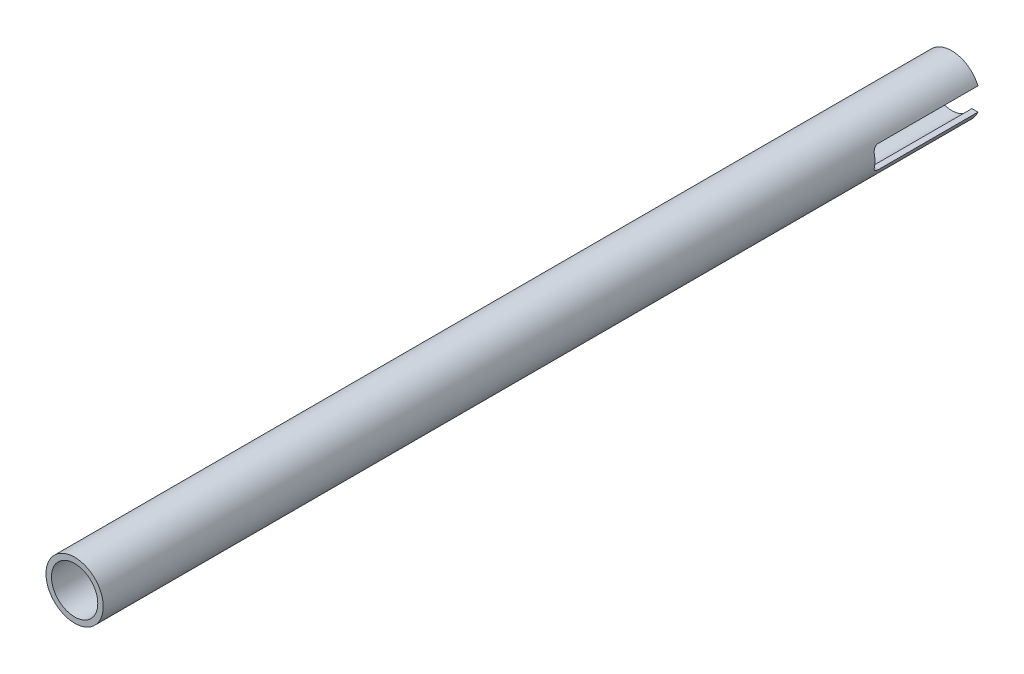
ISO-10303-21;
HEADER;
FILE_DESCRIPTION(('STEP AP214'),'2;1');
FILE_NAME('part.step','',(''),(''),'','','');
FILE_SCHEMA(('AUTOMOTIVE_DESIGN { 1 0 10303 214 1 1 1 1 }'));
ENDSEC;
DATA;
#1=APPLICATION_CONTEXT('core data for automotive mechanical design processes');
#2=APPLICATION_PROTOCOL_DEFINITION('international standard','automotive_design',2000,#1);
#3=PRODUCT_CONTEXT('',#1,'mechanical');
#4=PRODUCT('Part','Part','',(#3));
#5=PRODUCT_RELATED_PRODUCT_CATEGORY('part','',(#4));
#6=PRODUCT_DEFINITION_FORMATION('','',#4);
#7=PRODUCT_DEFINITION_CONTEXT('part definition',#1,'design');
#8=PRODUCT_DEFINITION('design','',#6,#7);
#9=PRODUCT_DEFINITION_SHAPE('','',#8);
#10=(LENGTH_UNIT() NAMED_UNIT(*) SI_UNIT(.MILLI.,.METRE.));
#11=(NAMED_UNIT(*) PLANE_ANGLE_UNIT() SI_UNIT($,.RADIAN.));
#12=(NAMED_UNIT(*) SI_UNIT($,.STERADIAN.) SOLID_ANGLE_UNIT());
#13=UNCERTAINTY_MEASURE_WITH_UNIT(LENGTH_MEASURE(1.E-05),#10,'distance_accuracy_value','');
#14=(GEOMETRIC_REPRESENTATION_CONTEXT(3) GLOBAL_UNCERTAINTY_ASSIGNED_CONTEXT((#13)) GLOBAL_UNIT_ASSIGNED_CONTEXT((#10,
#11,#12)) REPRESENTATION_CONTEXT('',''));
#15=CARTESIAN_POINT('',(0.,0.,0.));
#16=DIRECTION('',(0.,0.,1.));
#17=DIRECTION('',(1.,0.,0.));
#18=AXIS2_PLACEMENT_3D('',#15,#16,#17);
#19=CARTESIAN_POINT('',(0.,0.,0.));
#20=DIRECTION('',(0.,0.,1.));
#21=DIRECTION('',(1.,0.,0.));
#22=AXIS2_PLACEMENT_3D('',#19,#20,#21);
#23=PLANE('',#22);
#24=DIRECTION('',(-1.,0.,0.));
#25=VECTOR('',#24,1.);
#26=CARTESIAN_POINT('',(317.691841615587,-3.17500000000001,0.));
#27=LINE('',#26,#25);
#28=CARTESIAN_POINT('',(7.34407080575888,-3.17500000000001,0.));
#29=VERTEX_POINT('',#28);
#30=CARTESIAN_POINT('',(5.64543213580679,-3.17499999999999,0.));
#31=VERTEX_POINT('',#30);
#32=EDGE_CURVE('E57',#29,#31,#27,.T.);
#33=ORIENTED_EDGE('',*,*,#32,.F.);
#34=CARTESIAN_POINT('',(0.,0.,0.));
#35=DIRECTION('',(0.,0.,1.));
#36=DIRECTION('',(1.,0.,0.));
#37=AXIS2_PLACEMENT_3D('',#34,#35,#36);
#38=CIRCLE('',#37,8.001);
#39=CARTESIAN_POINT('',(-7.34407080575888,-3.17500000000001,0.));
#40=VERTEX_POINT('',#39);
#41=EDGE_CURVE('E146',#40,#29,#38,.T.);
#42=ORIENTED_EDGE('',*,*,#41,.F.);
#43=CARTESIAN_POINT('',(-5.64543213580682,-3.17500000000001,0.));
#44=VERTEX_POINT('',#43);
#45=EDGE_CURVE('E140',#44,#40,#27,.T.);
#46=ORIENTED_EDGE('',*,*,#45,.F.);
#47=CARTESIAN_POINT('',(0.,0.,0.));
#48=DIRECTION('',(0.,0.,1.));
#49=DIRECTION('',(1.,0.,0.));
#50=AXIS2_PLACEMENT_3D('',#47,#48,#49);
#51=CIRCLE('',#50,6.477);
#52=EDGE_CURVE('E242',#44,#31,#51,.T.);
#53=ORIENTED_EDGE('',*,*,#52,.T.);
#54=EDGE_LOOP('',(#33,#42,#46,#53));
#55=FACE_BOUND('',#54,.T.);
#56=ADVANCED_FACE('F33',(#55),#23,.F.);
#57=CARTESIAN_POINT('',(0.,0.,245.11));
#58=DIRECTION('',(0.,0.,-1.));
#59=DIRECTION('',(-1.,0.,0.));
#60=AXIS2_PLACEMENT_3D('',#57,#58,#59);
#61=CYLINDRICAL_SURFACE('',#60,8.001);
#62=CARTESIAN_POINT('',(0.,0.,245.11));
#63=DIRECTION('',(0.,0.,1.));
#64=DIRECTION('',(1.,0.,0.));
#65=AXIS2_PLACEMENT_3D('',#62,#63,#64);
#66=CIRCLE('',#65,8.001);
#67=CARTESIAN_POINT('',(8.001,0.,245.11));
#68=VERTEX_POINT('',#67);
#69=EDGE_CURVE('E249',#68,#68,#66,.T.);
#70=ORIENTED_EDGE('',*,*,#69,.F.);
#71=EDGE_LOOP('',(#70));
#72=FACE_BOUND('',#71,.T.);
#73=DIRECTION('',(0.,0.,-1.));
#74=VECTOR('',#73,1.);
#75=CARTESIAN_POINT('',(7.34407080575892,3.17499999999992,245.11));
#76=LINE('',#75,#74);
#77=CARTESIAN_POINT('',(7.34407080575894,3.175,0.));
#78=VERTEX_POINT('',#77);
#79=CARTESIAN_POINT('',(7.34407080575889,3.17499999999999,27.94));
#80=VERTEX_POINT('',#79);
#81=EDGE_CURVE('E238',#78,#80,#76,.F.);
#82=ORIENTED_EDGE('',*,*,#81,.F.);
#83=CARTESIAN_POINT('',(-7.34407080575894,3.175,0.));
#84=VERTEX_POINT('',#83);
#85=EDGE_CURVE('E253',#78,#84,#38,.T.);
#86=ORIENTED_EDGE('',*,*,#85,.T.);
#87=DIRECTION('',(0.,0.,-1.));
#88=VECTOR('',#87,1.);
#89=CARTESIAN_POINT('',(-7.34407080575892,3.17499999999992,245.11));
#90=LINE('',#89,#88);
#91=CARTESIAN_POINT('',(-7.34407080575889,3.17499999999999,27.94));
#92=VERTEX_POINT('',#91);
#93=EDGE_CURVE('E240',#92,#84,#90,.T.);
#94=ORIENTED_EDGE('',*,*,#93,.F.);
#95=CARTESIAN_POINT('',(-7.8288057837706,1.65099999999999,29.464));
#96=CARTESIAN_POINT('',(-7.81947795268345,1.69524181564514,29.4639996807889));
#97=CARTESIAN_POINT('',(-7.80977555287386,1.73937906238703,29.4620725755956));
#98=CARTESIAN_POINT('',(-7.7897053190962,1.82715995012294,29.4544259194222));
#99=CARTESIAN_POINT('',(-7.77933765259943,1.870803712116,29.4487073195399));
#100=CARTESIAN_POINT('',(-7.74740781787862,2.00038689143379,29.4259920832168));
#101=CARTESIAN_POINT('',(-7.72497172734663,2.08520038066884,29.4034353611242));
#102=CARTESIAN_POINT('',(-7.67879255624773,2.24931803273243,29.3443529357356));
#103=CARTESIAN_POINT('',(-7.65505009243317,2.32862475603218,29.307833776622));
#104=CARTESIAN_POINT('',(-7.60739952527334,2.47987144136615,29.2218403935313));
#105=CARTESIAN_POINT('',(-7.58349136309819,2.55180862700726,29.1723613118312));
#106=CARTESIAN_POINT('',(-7.53640113822511,2.68773877112478,29.0605553900397));
#107=CARTESIAN_POINT('',(-7.51324222932275,2.75155008701076,28.9979974672164));
#108=CARTESIAN_POINT('',(-7.46969556535498,2.86766507697724,28.8621080561482));
#109=CARTESIAN_POINT('',(-7.44930787514765,2.91996848174228,28.7887763158346));
#110=CARTESIAN_POINT('',(-7.41339882631975,3.00995182097469,28.635356056821));
#111=CARTESIAN_POINT('',(-7.39775949227146,3.04799299625044,28.555507568052));
#112=CARTESIAN_POINT('',(-7.37198636942665,3.10981595853761,28.3896963126839));
#113=CARTESIAN_POINT('',(-7.36184321814923,3.13362200161646,28.3037442276388));
#114=CARTESIAN_POINT('',(-7.35134082404798,3.15814271182933,28.170748149592));
#115=CARTESIAN_POINT('',(-7.34862226710174,3.16445643648463,28.1248527548858));
#116=CARTESIAN_POINT('',(-7.34498545577234,3.17288497032065,28.0326477775769));
#117=CARTESIAN_POINT('',(-7.34406565426136,3.17500338794749,27.9863385853611));
#118=CARTESIAN_POINT('',(-7.34407080575889,3.17499999999999,27.94));
#119=B_SPLINE_CURVE_WITH_KNOTS('',3,(#95,#96,#97,#98,#99,#100,#101,#102,#103,#104,#105,#106,
#107,#108,#109,#110,#111,#112,#113,#114,#115,#116,#117,#118),.UNSPECIFIED.,.F.,.F.,(4,2,2,2,2,2,
2,2,2,2,2,4),(0.,0.135553024626245,0.271072058592374,0.541437670457962,0.811676717226676,
1.08201720207601,1.35761362878683,1.63321650449497,1.90127196271359,2.16886935439239,
2.30789050122071,2.44679202186551),.UNSPECIFIED.);
#120=CARTESIAN_POINT('',(-7.8288057837706,1.65099999999999,29.464));
#121=VERTEX_POINT('',#120);
#122=EDGE_CURVE('E226',#121,#92,#119,.T.);
#123=ORIENTED_EDGE('',*,*,#122,.F.);
#124=CARTESIAN_POINT('',(0.,0.,29.464));
#125=DIRECTION('',(0.,0.,-1.));
#126=DIRECTION('',(-1.,0.,0.));
#127=AXIS2_PLACEMENT_3D('',#124,#125,#126);
#128=CIRCLE('',#127,8.001);
#129=CARTESIAN_POINT('',(-7.8288057837706,-1.651,29.464));
#130=VERTEX_POINT('',#129);
#131=EDGE_CURVE('E134',#130,#121,#128,.T.);
#132=ORIENTED_EDGE('',*,*,#131,.F.);
#133=CARTESIAN_POINT('',(-7.34407080575888,-3.175,27.94));
#134=CARTESIAN_POINT('',(-7.3440680096913,-3.17500157818638,27.9806984476088));
#135=CARTESIAN_POINT('',(-7.34477630214677,-3.17336860893187,28.0213759502433));
#136=CARTESIAN_POINT('',(-7.34758309143993,-3.16686635956913,28.102411407968));
#137=CARTESIAN_POINT('',(-7.34968118035477,-3.16199802907896,28.1427694533067));
#138=CARTESIAN_POINT('',(-7.35798857580184,-3.14264423927033,28.2626338560667));
#139=CARTESIAN_POINT('',(-7.36621159330718,-3.12340930879257,28.3412906881812));
#140=CARTESIAN_POINT('',(-7.38735918413182,-3.07305366060584,28.4938993996992));
#141=CARTESIAN_POINT('',(-7.40028060607282,-3.04194090905529,28.567854393813));
#142=CARTESIAN_POINT('',(-7.4298815779994,-2.96890708335138,28.7094453435949));
#143=CARTESIAN_POINT('',(-7.44656372650464,-2.92697853298672,28.7770768840646));
#144=CARTESIAN_POINT('',(-7.48338951433548,-2.83153727514407,28.9073193992745));
#145=CARTESIAN_POINT('',(-7.5036517696014,-2.77760154335605,28.9695861247467));
#146=CARTESIAN_POINT('',(-7.54586923311684,-2.66077336101834,29.0843978381578));
#147=CARTESIAN_POINT('',(-7.56782510086072,-2.59787741319581,29.1369390116058));
#148=CARTESIAN_POINT('',(-7.61377353576087,-2.46009532987571,29.23442490565));
#149=CARTESIAN_POINT('',(-7.63780327629239,-2.38468542927396,29.278613263246));
#150=CARTESIAN_POINT('',(-7.68517828309943,-2.22728162943213,29.3535295949975));
#151=CARTESIAN_POINT('',(-7.70852388215322,-2.14529100625114,29.3842642181982));
#152=CARTESIAN_POINT('',(-7.74866065435345,-1.99473307846588,29.4263269168587));
#153=CARTESIAN_POINT('',(-7.76579152458538,-1.9270088220366,29.4403889784846));
#154=CARTESIAN_POINT('',(-7.79853598216448,-1.78994063052702,29.4592336722557));
#155=CARTESIAN_POINT('',(-7.81414985826825,-1.7205970068191,29.4640180736839));
#156=CARTESIAN_POINT('',(-7.8288057837706,-1.651,29.464));
#157=B_SPLINE_CURVE_WITH_KNOTS('',3,(#133,#134,#135,#136,#137,#138,#139,#140,#141,#142,#143,
#144,#145,#146,#147,#148,#149,#150,#151,#152,#153,#154,#155,#156),.UNSPECIFIED.,.F.,.F.,(4,2,2,
2,2,2,2,2,2,2,2,4),(0.,0.12201561431295,0.243995431359554,0.486888996424004,0.729619944201783,
0.972519126749115,1.225937118326,1.47945429417213,1.75015649231414,2.02072475374975,
2.23388433321155,2.44700325838137),.UNSPECIFIED.);
#158=CARTESIAN_POINT('',(-7.34407080575888,-3.175,27.94));
#159=VERTEX_POINT('',#158);
#160=EDGE_CURVE('E135',#159,#130,#157,.T.);
#161=ORIENTED_EDGE('',*,*,#160,.F.);
#162=DIRECTION('',(0.,0.,-1.));
#163=VECTOR('',#162,1.);
#164=CARTESIAN_POINT('',(-7.34407080575889,-3.17499999999999,245.11));
#165=LINE('',#164,#163);
#166=EDGE_CURVE('E147',#40,#159,#165,.F.);
#167=ORIENTED_EDGE('',*,*,#166,.F.);
#168=ORIENTED_EDGE('',*,*,#41,.T.);
#169=DIRECTION('',(0.,0.,-1.));
#170=VECTOR('',#169,1.);
#171=CARTESIAN_POINT('',(7.34407080575889,-3.17499999999999,245.11));
#172=LINE('',#171,#170);
#173=CARTESIAN_POINT('',(7.34407080575888,-3.175,27.94));
#174=VERTEX_POINT('',#173);
#175=EDGE_CURVE('E138',#174,#29,#172,.T.);
#176=ORIENTED_EDGE('',*,*,#175,.F.);
#177=CARTESIAN_POINT('',(7.8288057837706,-1.651,29.464));
#178=CARTESIAN_POINT('',(7.81947795268344,-1.69524181564515,29.4639996807889));
#179=CARTESIAN_POINT('',(7.80977555287386,-1.73937906238705,29.4620725755956));
#180=CARTESIAN_POINT('',(7.78970531909619,-1.82715995012295,29.4544259194222));
#181=CARTESIAN_POINT('',(7.77933765259943,-1.87080371211601,29.4487073195399));
#182=CARTESIAN_POINT('',(7.74740781787862,-2.0003868914338,29.4259920832168));
#183=CARTESIAN_POINT('',(7.72497172734662,-2.08520038066886,29.4034353611242));
#184=CARTESIAN_POINT('',(7.67879255624773,-2.24931803273244,29.3443529357356));
#185=CARTESIAN_POINT('',(7.65505009243317,-2.32862475603219,29.307833776622));
#186=CARTESIAN_POINT('',(7.60739952527334,-2.47987144136616,29.2218403935313));
#187=CARTESIAN_POINT('',(7.58349136309819,-2.55180862700727,29.1723613118312));
#188=CARTESIAN_POINT('',(7.5364011382251,-2.6877387711248,29.0605553900397));
#189=CARTESIAN_POINT('',(7.51324222932275,-2.75155008701078,28.9979974672164));
#190=CARTESIAN_POINT('',(7.46969556535497,-2.86766507697726,28.8621080561482));
#191=CARTESIAN_POINT('',(7.44930787514765,-2.9199684817423,28.7887763158346));
#192=CARTESIAN_POINT('',(7.41339882631975,-3.0099518209747,28.635356056821));
#193=CARTESIAN_POINT('',(7.39775949227145,-3.04799299625045,28.555507568052));
#194=CARTESIAN_POINT('',(7.37198636942665,-3.10981595853763,28.3896963126839));
#195=CARTESIAN_POINT('',(7.36184321814923,-3.13362200161647,28.3037442276388));
#196=CARTESIAN_POINT('',(7.35134082404798,-3.15814271182935,28.170748149592));
#197=CARTESIAN_POINT('',(7.34862226710173,-3.16445643648464,28.1248527548858));
#198=CARTESIAN_POINT('',(7.34498545577233,-3.17288497032067,28.0326477775769));
#199=CARTESIAN_POINT('',(7.34406565426135,-3.17500338794751,27.9863385853611));
#200=CARTESIAN_POINT('',(7.34407080575888,-3.175,27.94));
#201=B_SPLINE_CURVE_WITH_KNOTS('',3,(#177,#178,#179,#180,#181,#182,#183,#184,#185,#186,#187,
#188,#189,#190,#191,#192,#193,#194,#195,#196,#197,#198,#199,#200),.UNSPECIFIED.,.F.,.F.,(4,2,2,
2,2,2,2,2,2,2,2,4),(0.,0.135553024626244,0.271072058592373,0.541437670457962,0.811676717226674,
1.08201720207601,1.35761362878684,1.63321650449498,1.9012719627136,2.16886935439239,
2.30789050122071,2.44679202186551),.UNSPECIFIED.);
#202=CARTESIAN_POINT('',(7.8288057837706,-1.651,29.464));
#203=VERTEX_POINT('',#202);
#204=EDGE_CURVE('E124',#203,#174,#201,.T.);
#205=ORIENTED_EDGE('',*,*,#204,.F.);
#206=CARTESIAN_POINT('',(7.8288057837706,1.65099999999999,29.464));
#207=VERTEX_POINT('',#206);
#208=EDGE_CURVE('E232',#207,#203,#128,.T.);
#209=ORIENTED_EDGE('',*,*,#208,.F.);
#210=CARTESIAN_POINT('',(7.34407080575889,3.17499999999999,27.94));
#211=CARTESIAN_POINT('',(7.34406800969131,3.17500157818637,27.9806984476088));
#212=CARTESIAN_POINT('',(7.34477630214678,3.17336860893186,28.0213759502433));
#213=CARTESIAN_POINT('',(7.34758309143993,3.16686635956911,28.102411407968));
#214=CARTESIAN_POINT('',(7.34968118035478,3.16199802907895,28.1427694533067));
#215=CARTESIAN_POINT('',(7.35798857580184,3.14264423927032,28.2626338560667));
#216=CARTESIAN_POINT('',(7.36621159330719,3.12340930879256,28.3412906881812));
#217=CARTESIAN_POINT('',(7.38735918413182,3.07305366060582,28.4938993996992));
#218=CARTESIAN_POINT('',(7.40028060607282,3.04194090905528,28.567854393813));
#219=CARTESIAN_POINT('',(7.4298815779994,2.96890708335136,28.7094453435949));
#220=CARTESIAN_POINT('',(7.44656372650465,2.92697853298671,28.7770768840646));
#221=CARTESIAN_POINT('',(7.48338951433549,2.83153727514406,28.9073193992745));
#222=CARTESIAN_POINT('',(7.50365176960141,2.77760154335604,28.9695861247467));
#223=CARTESIAN_POINT('',(7.54586923311685,2.66077336101832,29.0843978381578));
#224=CARTESIAN_POINT('',(7.56782510086072,2.5978774131958,29.1369390116058));
#225=CARTESIAN_POINT('',(7.61377353576087,2.4600953298757,29.23442490565));
#226=CARTESIAN_POINT('',(7.6378032762924,2.38468542927395,29.278613263246));
#227=CARTESIAN_POINT('',(7.68517828309944,2.22728162943211,29.3535295949975));
#228=CARTESIAN_POINT('',(7.70852388215323,2.14529100625113,29.3842642181981));
#229=CARTESIAN_POINT('',(7.74866065435345,1.99473307846587,29.4263269168587));
#230=CARTESIAN_POINT('',(7.76579152458538,1.92700882203658,29.4403889784846));
#231=CARTESIAN_POINT('',(7.79853598216448,1.78994063052701,29.4592336722557));
#232=CARTESIAN_POINT('',(7.81414985826825,1.72059700681908,29.4640180736839));
#233=CARTESIAN_POINT('',(7.8288057837706,1.65099999999999,29.464));
#234=B_SPLINE_CURVE_WITH_KNOTS('',3,(#210,#211,#212,#213,#214,#215,#216,#217,#218,#219,#220,
#221,#222,#223,#224,#225,#226,#227,#228,#229,#230,#231,#232,#233),.UNSPECIFIED.,.F.,.F.,(4,2,2,
2,2,2,2,2,2,2,2,4),(0.,0.12201561431295,0.243995431359554,0.486888996424004,0.729619944201783,
0.972519126749115,1.22593711832599,1.47945429417213,1.75015649231413,2.02072475374975,
2.23388433321155,2.44700325838137),.UNSPECIFIED.);
#235=EDGE_CURVE('E231',#80,#207,#234,.T.);
#236=ORIENTED_EDGE('',*,*,#235,.F.);
#237=EDGE_LOOP('',(#82,#86,#94,#123,#132,#161,#167,#168,#176,#205,#209,#236));
#238=FACE_BOUND('',#237,.T.);
#239=ADVANCED_FACE('F35',(#72,#238),#61,.T.);
#240=CARTESIAN_POINT('',(0.,0.,245.11));
#241=DIRECTION('',(0.,0.,-1.));
#242=DIRECTION('',(-1.,0.,0.));
#243=AXIS2_PLACEMENT_3D('',#240,#241,#242);
#244=CYLINDRICAL_SURFACE('',#243,6.477);
#245=CARTESIAN_POINT('',(0.,0.,245.11));
#246=DIRECTION('',(0.,0.,1.));
#247=DIRECTION('',(1.,0.,0.));
#248=AXIS2_PLACEMENT_3D('',#245,#246,#247);
#249=CIRCLE('',#248,6.477);
#250=CARTESIAN_POINT('',(6.477,0.,245.11));
#251=VERTEX_POINT('',#250);
#252=EDGE_CURVE('E243',#251,#251,#249,.T.);
#253=ORIENTED_EDGE('',*,*,#252,.T.);
#254=EDGE_LOOP('',(#253));
#255=FACE_BOUND('',#254,.T.);
#256=CARTESIAN_POINT('',(5.64543213580682,3.175,0.));
#257=VERTEX_POINT('',#256);
#258=CARTESIAN_POINT('',(-5.64543213580682,3.175,0.));
#259=VERTEX_POINT('',#258);
#260=EDGE_CURVE('E246',#257,#259,#51,.T.);
#261=ORIENTED_EDGE('',*,*,#260,.F.);
#262=DIRECTION('',(0.,0.,-1.));
#263=VECTOR('',#262,1.);
#264=CARTESIAN_POINT('',(5.64543213580683,3.17499999999992,245.11));
#265=LINE('',#264,#263);
#266=CARTESIAN_POINT('',(5.64543213580679,3.17499999999999,27.94));
#267=VERTEX_POINT('',#266);
#268=EDGE_CURVE('E11',#257,#267,#265,.F.);
#269=ORIENTED_EDGE('',*,*,#268,.T.);
#270=CARTESIAN_POINT('',(5.64543213580679,3.17499999999999,27.94));
#271=CARTESIAN_POINT('',(5.64542798532432,3.17500253012491,27.9795022750384));
#272=CARTESIAN_POINT('',(5.64629676751123,3.17346305780188,28.0189831851797));
#273=CARTESIAN_POINT('',(5.64973489172762,3.16734010596934,28.097616333837));
#274=CARTESIAN_POINT('',(5.65230347216193,3.16275798971433,28.1367687115998));
#275=CARTESIAN_POINT('',(5.6624528235623,3.14457608288719,28.2529070155873));
#276=CARTESIAN_POINT('',(5.67247830845162,3.12653965087181,28.3290381879893));
#277=CARTESIAN_POINT('',(5.69814957474154,3.07950075965754,28.4766255007952));
#278=CARTESIAN_POINT('',(5.71378770060105,3.05051323473278,28.5480878532046));
#279=CARTESIAN_POINT('',(5.74949312759986,2.98267072120713,28.6850337996201));
#280=CARTESIAN_POINT('',(5.76956543427929,2.94380457356396,28.7505105176722));
#281=CARTESIAN_POINT('',(5.81427344287328,2.85454020484129,28.8783725064171));
#282=CARTESIAN_POINT('',(5.83912294015509,2.80355001313473,28.9402682413202));
#283=CARTESIAN_POINT('',(5.89090094280743,2.69305400468479,29.0549190340714));
#284=CARTESIAN_POINT('',(5.91783040535228,2.63354425646504,29.1076698468731));
#285=CARTESIAN_POINT('',(5.9754026920417,2.50037980782341,29.2083991647787));
#286=CARTESIAN_POINT('',(6.00613015030678,2.42589024924425,29.2552294493506));
#287=CARTESIAN_POINT('',(6.06685054178971,2.26977298542592,29.3354912659983));
#288=CARTESIAN_POINT('',(6.09684379767183,2.18814849062352,29.3689287868608));
#289=CARTESIAN_POINT('',(6.15068954263711,2.03135452128191,29.4177262918858));
#290=CARTESIAN_POINT('',(6.17481721444706,1.95685658409068,29.4349485076857));
#291=CARTESIAN_POINT('',(6.2208090046563,1.80539896583251,29.4581012531514));
#292=CARTESIAN_POINT('',(6.24267154884634,1.72843762073706,29.4640239790673));
#293=CARTESIAN_POINT('',(6.26304462701648,1.65099999999999,29.464));
#294=B_SPLINE_CURVE_WITH_KNOTS('',3,(#270,#271,#272,#273,#274,#275,#276,#277,#278,#279,#280,
#281,#282,#283,#284,#285,#286,#287,#288,#289,#290,#291,#292,#293),.UNSPECIFIED.,.F.,.F.,(4,2,2,
2,2,2,2,2,2,2,2,4),(0.,0.11842611788255,0.236799210795264,0.472172634307249,0.707226225252081,
0.942546525606805,1.19340365391803,1.44437691938388,1.72272641785955,2.0009513086068,
2.24064521780671,2.48050460661626),.UNSPECIFIED.);
#295=CARTESIAN_POINT('',(6.26304462701648,1.65099999999999,29.464));
#296=VERTEX_POINT('',#295);
#297=EDGE_CURVE('E42',#267,#296,#294,.T.);
#298=ORIENTED_EDGE('',*,*,#297,.T.);
#299=CARTESIAN_POINT('',(0.,0.,29.464));
#300=DIRECTION('',(0.,0.,-1.));
#301=DIRECTION('',(-1.,0.,0.));
#302=AXIS2_PLACEMENT_3D('',#299,#300,#301);
#303=CIRCLE('',#302,6.477);
#304=CARTESIAN_POINT('',(6.26304462701648,-1.651,29.464));
#305=VERTEX_POINT('',#304);
#306=EDGE_CURVE('E189',#296,#305,#303,.T.);
#307=ORIENTED_EDGE('',*,*,#306,.T.);
#308=CARTESIAN_POINT('',(6.26304462701648,-1.651,29.464));
#309=CARTESIAN_POINT('',(6.25119301356599,-1.69597019045451,29.4639996512927));
#310=CARTESIAN_POINT('',(6.23885805015263,-1.74078424361484,29.4620087653986));
#311=CARTESIAN_POINT('',(6.21333080831813,-1.82980515275705,29.454134138941));
#312=CARTESIAN_POINT('',(6.20013884930389,-1.87401222760585,29.4482518413062));
#313=CARTESIAN_POINT('',(6.15951133396887,-2.00506101361784,29.4249457970163));
#314=CARTESIAN_POINT('',(6.13094979172369,-2.09061085165534,29.4018617467996));
#315=CARTESIAN_POINT('',(6.07212151471614,-2.25578612168244,29.3416219603263));
#316=CARTESIAN_POINT('',(6.04185654214358,-2.33541748531391,29.3044805465843));
#317=CARTESIAN_POINT('',(5.98100165398782,-2.48713337520253,29.2171532445204));
#318=CARTESIAN_POINT('',(5.95041151302896,-2.55921223237762,29.1669576544588));
#319=CARTESIAN_POINT('',(5.88959770370069,-2.69629003214929,29.0527307014112));
#320=CARTESIAN_POINT('',(5.85942026108732,-2.76097278644595,28.9882938275107));
#321=CARTESIAN_POINT('',(5.80262181829034,-2.87843237174363,28.8479375307773));
#322=CARTESIAN_POINT('',(5.77600068690932,-2.93120964200445,28.7720185317567));
#323=CARTESIAN_POINT('',(5.72961508062246,-3.02084256755071,28.6138173863488));
#324=CARTESIAN_POINT('',(5.70961192114585,-3.05826802843451,28.5319300118511));
#325=CARTESIAN_POINT('',(5.67705818777086,-3.11828924116529,28.3615909438744));
#326=CARTESIAN_POINT('',(5.66448853762436,-3.14092296814996,28.2731567140417));
#327=CARTESIAN_POINT('',(5.65274801817815,-3.16196375608022,28.143042864781));
#328=CARTESIAN_POINT('',(5.65001234622036,-3.16684526064363,28.1026313476031));
#329=CARTESIAN_POINT('',(5.64635324825543,-3.17336296637714,28.0214890576694));
#330=CARTESIAN_POINT('',(5.64542881846813,-3.17500096508517,27.980758474312));
#331=CARTESIAN_POINT('',(5.64543213580679,-3.175,27.94));
#332=B_SPLINE_CURVE_WITH_KNOTS('',3,(#308,#309,#310,#311,#312,#313,#314,#315,#316,#317,#318,
#319,#320,#321,#322,#323,#324,#325,#326,#327,#328,#329,#330,#331),.UNSPECIFIED.,.F.,.F.,(4,2,2,
2,2,2,2,2,2,2,2,4),(0.,0.13941997674178,0.278788285754549,0.556665652257205,0.834260658887698,
1.11206256399923,1.39912695233711,1.68618074753331,1.96132294859871,2.23575596690123,
2.35800176569004,2.4801797973654),.UNSPECIFIED.);
#333=CARTESIAN_POINT('',(5.64543213580682,-3.175,27.94));
#334=VERTEX_POINT('',#333);
#335=EDGE_CURVE('E183',#305,#334,#332,.T.);
#336=ORIENTED_EDGE('',*,*,#335,.T.);
#337=DIRECTION('',(0.,0.,-1.));
#338=VECTOR('',#337,1.);
#339=CARTESIAN_POINT('',(5.64543213580679,-3.17499999999999,245.11));
#340=LINE('',#339,#338);
#341=EDGE_CURVE('E139',#334,#31,#340,.T.);
#342=ORIENTED_EDGE('',*,*,#341,.T.);
#343=ORIENTED_EDGE('',*,*,#52,.F.);
#344=DIRECTION('',(0.,0.,-1.));
#345=VECTOR('',#344,1.);
#346=CARTESIAN_POINT('',(-5.64543213580679,-3.17499999999999,245.11));
#347=LINE('',#346,#345);
#348=CARTESIAN_POINT('',(-5.64543213580679,-3.17499999999999,27.94));
#349=VERTEX_POINT('',#348);
#350=EDGE_CURVE('E252',#44,#349,#347,.F.);
#351=ORIENTED_EDGE('',*,*,#350,.T.);
#352=CARTESIAN_POINT('',(-5.64543213580679,-3.175,27.94));
#353=CARTESIAN_POINT('',(-5.64542798532432,-3.17500253012492,27.9795022750384));
#354=CARTESIAN_POINT('',(-5.64629676751122,-3.17346305780189,28.0189831851797));
#355=CARTESIAN_POINT('',(-5.64973489172761,-3.16734010596935,28.097616333837));
#356=CARTESIAN_POINT('',(-5.65230347216192,-3.16275798971435,28.1367687115998));
#357=CARTESIAN_POINT('',(-5.6624528235623,-3.1445760828872,28.2529070155873));
#358=CARTESIAN_POINT('',(-5.67247830845161,-3.12653965087182,28.3290381879893));
#359=CARTESIAN_POINT('',(-5.69814957474154,-3.07950075965756,28.4766255007952));
#360=CARTESIAN_POINT('',(-5.71378770060104,-3.05051323473279,28.5480878532046));
#361=CARTESIAN_POINT('',(-5.74949312759985,-2.98267072120715,28.6850337996201));
#362=CARTESIAN_POINT('',(-5.76956543427929,-2.94380457356397,28.7505105176722));
#363=CARTESIAN_POINT('',(-5.81427344287327,-2.8545402048413,28.8783725064171));
#364=CARTESIAN_POINT('',(-5.83912294015508,-2.80355001313474,28.9402682413202));
#365=CARTESIAN_POINT('',(-5.89090094280742,-2.69305400468481,29.0549190340714));
#366=CARTESIAN_POINT('',(-5.91783040535228,-2.63354425646506,29.1076698468731));
#367=CARTESIAN_POINT('',(-5.97540269204169,-2.50037980782343,29.2083991647787));
#368=CARTESIAN_POINT('',(-6.00613015030677,-2.42589024924427,29.2552294493506));
#369=CARTESIAN_POINT('',(-6.06685054178971,-2.26977298542593,29.3354912659983));
#370=CARTESIAN_POINT('',(-6.09684379767183,-2.18814849062354,29.3689287868608));
#371=CARTESIAN_POINT('',(-6.1506895426371,-2.03135452128192,29.4177262918858));
#372=CARTESIAN_POINT('',(-6.17481721444706,-1.95685658409069,29.4349485076857));
#373=CARTESIAN_POINT('',(-6.2208090046563,-1.80539896583253,29.4581012531514));
#374=CARTESIAN_POINT('',(-6.24267154884634,-1.72843762073707,29.4640239790673));
#375=CARTESIAN_POINT('',(-6.26304462701648,-1.651,29.464));
#376=B_SPLINE_CURVE_WITH_KNOTS('',3,(#352,#353,#354,#355,#356,#357,#358,#359,#360,#361,#362,
#363,#364,#365,#366,#367,#368,#369,#370,#371,#372,#373,#374,#375),.UNSPECIFIED.,.F.,.F.,(4,2,2,
2,2,2,2,2,2,2,2,4),(0.,0.11842611788255,0.236799210795268,0.472172634307249,0.707226225252081,
0.942546525606805,1.19340365391803,1.44437691938388,1.72272641785955,2.0009513086068,
2.24064521780671,2.48050460661626),.UNSPECIFIED.);
#377=CARTESIAN_POINT('',(-6.26304462701648,-1.651,29.464));
#378=VERTEX_POINT('',#377);
#379=EDGE_CURVE('E173',#349,#378,#376,.T.);
#380=ORIENTED_EDGE('',*,*,#379,.T.);
#381=CARTESIAN_POINT('',(-6.26304462701648,1.65099999999999,29.464));
#382=VERTEX_POINT('',#381);
#383=EDGE_CURVE('E214',#378,#382,#303,.T.);
#384=ORIENTED_EDGE('',*,*,#383,.T.);
#385=CARTESIAN_POINT('',(-6.26304462701648,1.65099999999999,29.464));
#386=CARTESIAN_POINT('',(-6.251193013566,1.6959701904545,29.4639996512927));
#387=CARTESIAN_POINT('',(-6.23885805015264,1.74078424361482,29.4620087653986));
#388=CARTESIAN_POINT('',(-6.21333080831813,1.82980515275704,29.454134138941));
#389=CARTESIAN_POINT('',(-6.20013884930389,1.87401222760583,29.4482518413062));
#390=CARTESIAN_POINT('',(-6.15951133396887,2.00506101361782,29.4249457970163));
#391=CARTESIAN_POINT('',(-6.1309497917237,2.09061085165533,29.4018617467996));
#392=CARTESIAN_POINT('',(-6.07212151471614,2.25578612168242,29.3416219603263));
#393=CARTESIAN_POINT('',(-6.04185654214358,2.3354174853139,29.3044805465843));
#394=CARTESIAN_POINT('',(-5.98100165398783,2.48713337520252,29.2171532445204));
#395=CARTESIAN_POINT('',(-5.95041151302897,2.5592122323776,29.1669576544588));
#396=CARTESIAN_POINT('',(-5.8895977037007,2.69629003214927,29.0527307014112));
#397=CARTESIAN_POINT('',(-5.85942026108733,2.76097278644594,28.9882938275107));
#398=CARTESIAN_POINT('',(-5.80262181829034,2.87843237174362,28.8479375307773));
#399=CARTESIAN_POINT('',(-5.77600068690933,2.93120964200444,28.7720185317567));
#400=CARTESIAN_POINT('',(-5.72961508062246,3.02084256755069,28.6138173863488));
#401=CARTESIAN_POINT('',(-5.70961192114586,3.0582680284345,28.5319300118511));
#402=CARTESIAN_POINT('',(-5.67705818777087,3.11828924116528,28.3615909438744));
#403=CARTESIAN_POINT('',(-5.66448853762437,3.14092296814994,28.2731567140417));
#404=CARTESIAN_POINT('',(-5.65274801817816,3.16196375608021,28.143042864781));
#405=CARTESIAN_POINT('',(-5.65001234622037,3.16684526064362,28.1026313476031));
#406=CARTESIAN_POINT('',(-5.64635324825544,3.17336296637713,28.0214890576694));
#407=CARTESIAN_POINT('',(-5.64542881846814,3.17500096508516,27.980758474312));
#408=CARTESIAN_POINT('',(-5.6454321358068,3.17499999999999,27.94));
#409=B_SPLINE_CURVE_WITH_KNOTS('',3,(#385,#386,#387,#388,#389,#390,#391,#392,#393,#394,#395,
#396,#397,#398,#399,#400,#401,#402,#403,#404,#405,#406,#407,#408),.UNSPECIFIED.,.F.,.F.,(4,2,2,
2,2,2,2,2,2,2,2,4),(0.,0.13941997674178,0.278788285754548,0.556665652257204,0.834260658887697,
1.11206256399923,1.39912695233711,1.68618074753331,1.9613229485987,2.23575596690122,
2.35800176569004,2.4801797973654),.UNSPECIFIED.);
#410=CARTESIAN_POINT('',(-5.64543213580679,3.17499999999999,27.94));
#411=VERTEX_POINT('',#410);
#412=EDGE_CURVE('E207',#382,#411,#409,.T.);
#413=ORIENTED_EDGE('',*,*,#412,.T.);
#414=DIRECTION('',(0.,0.,-1.));
#415=VECTOR('',#414,1.);
#416=CARTESIAN_POINT('',(-5.64543213580683,3.17499999999992,245.11));
#417=LINE('',#416,#415);
#418=EDGE_CURVE('E213',#411,#259,#417,.T.);
#419=ORIENTED_EDGE('',*,*,#418,.T.);
#420=EDGE_LOOP('',(#261,#269,#298,#307,#336,#342,#343,#351,#380,#384,#413,#419));
#421=FACE_BOUND('',#420,.T.);
#422=ADVANCED_FACE('F195',(#255,#421),#244,.F.);
#423=CARTESIAN_POINT('',(0.,0.,245.11));
#424=DIRECTION('',(0.,0.,1.));
#425=DIRECTION('',(1.,0.,0.));
#426=AXIS2_PLACEMENT_3D('',#423,#424,#425);
#427=PLANE('',#426);
#428=ORIENTED_EDGE('',*,*,#69,.T.);
#429=EDGE_LOOP('',(#428));
#430=FACE_BOUND('',#429,.T.);
#431=ORIENTED_EDGE('',*,*,#252,.F.);
#432=EDGE_LOOP('',(#431));
#433=FACE_BOUND('',#432,.T.);
#434=ADVANCED_FACE('F200',(#430,#433),#427,.T.);
#435=ORIENTED_EDGE('',*,*,#85,.F.);
#436=DIRECTION('',(-1.,0.,0.));
#437=VECTOR('',#436,1.);
#438=CARTESIAN_POINT('',(317.691841615587,3.175,0.));
#439=LINE('',#438,#437);
#440=EDGE_CURVE('E150',#78,#257,#439,.T.);
#441=ORIENTED_EDGE('',*,*,#440,.T.);
#442=ORIENTED_EDGE('',*,*,#260,.T.);
#443=EDGE_CURVE('E272',#259,#84,#439,.T.);
#444=ORIENTED_EDGE('',*,*,#443,.T.);
#445=EDGE_LOOP('',(#435,#441,#442,#444));
#446=FACE_BOUND('',#445,.T.);
#447=ADVANCED_FACE('F295',(#446),#23,.F.);
#448=CARTESIAN_POINT('',(317.691841615587,-3.175,27.94));
#449=DIRECTION('',(0.,1.,0.));
#450=DIRECTION('',(0.,0.,1.));
#451=AXIS2_PLACEMENT_3D('',#448,#449,#450);
#452=PLANE('',#451);
#453=ORIENTED_EDGE('',*,*,#45,.T.);
#454=ORIENTED_EDGE('',*,*,#166,.T.);
#455=DIRECTION('',(-1.,0.,0.));
#456=VECTOR('',#455,1.);
#457=CARTESIAN_POINT('',(317.691841615587,-3.175,27.94));
#458=LINE('',#457,#456);
#459=EDGE_CURVE('E49',#349,#159,#458,.T.);
#460=ORIENTED_EDGE('',*,*,#459,.F.);
#461=ORIENTED_EDGE('',*,*,#350,.F.);
#462=EDGE_LOOP('',(#453,#454,#460,#461));
#463=FACE_BOUND('',#462,.T.);
#464=ADVANCED_FACE('F285',(#463),#452,.T.);
#465=CARTESIAN_POINT('',(317.691841615587,-1.651,27.94));
#466=DIRECTION('',(-1.,0.,0.));
#467=DIRECTION('',(0.,0.,1.));
#468=AXIS2_PLACEMENT_3D('',#465,#466,#467);
#469=CYLINDRICAL_SURFACE('',#468,1.524);
#470=ORIENTED_EDGE('',*,*,#459,.T.);
#471=ORIENTED_EDGE('',*,*,#160,.T.);
#472=DIRECTION('',(-1.,0.,0.));
#473=VECTOR('',#472,1.);
#474=CARTESIAN_POINT('',(317.691841615587,-1.651,29.464));
#475=LINE('',#474,#473);
#476=EDGE_CURVE('E281',#378,#130,#475,.T.);
#477=ORIENTED_EDGE('',*,*,#476,.F.);
#478=ORIENTED_EDGE('',*,*,#379,.F.);
#479=EDGE_LOOP('',(#470,#471,#477,#478));
#480=FACE_BOUND('',#479,.T.);
#481=ADVANCED_FACE('F168',(#480),#469,.F.);
#482=CARTESIAN_POINT('',(317.691841615587,1.65099999999999,29.464));
#483=DIRECTION('',(0.,0.,-1.));
#484=DIRECTION('',(-1.,0.,0.));
#485=AXIS2_PLACEMENT_3D('',#482,#483,#484);
#486=PLANE('',#485);
#487=ORIENTED_EDGE('',*,*,#476,.T.);
#488=ORIENTED_EDGE('',*,*,#131,.T.);
#489=DIRECTION('',(-1.,0.,0.));
#490=VECTOR('',#489,1.);
#491=CARTESIAN_POINT('',(317.691841615587,1.65099999999999,29.464));
#492=LINE('',#491,#490);
#493=EDGE_CURVE('E278',#382,#121,#492,.T.);
#494=ORIENTED_EDGE('',*,*,#493,.F.);
#495=ORIENTED_EDGE('',*,*,#383,.F.);
#496=EDGE_LOOP('',(#487,#488,#494,#495));
#497=FACE_BOUND('',#496,.T.);
#498=ADVANCED_FACE('F300',(#497),#486,.T.);
#499=CARTESIAN_POINT('',(317.691841615587,1.65099999999999,27.94));
#500=DIRECTION('',(-1.,0.,0.));
#501=DIRECTION('',(0.,0.,1.));
#502=AXIS2_PLACEMENT_3D('',#499,#500,#501);
#503=CYLINDRICAL_SURFACE('',#502,1.524);
#504=ORIENTED_EDGE('',*,*,#493,.T.);
#505=ORIENTED_EDGE('',*,*,#122,.T.);
#506=DIRECTION('',(-1.,0.,0.));
#507=VECTOR('',#506,1.);
#508=CARTESIAN_POINT('',(317.691841615587,3.17499999999999,27.94));
#509=LINE('',#508,#507);
#510=EDGE_CURVE('E273',#411,#92,#509,.T.);
#511=ORIENTED_EDGE('',*,*,#510,.F.);
#512=ORIENTED_EDGE('',*,*,#412,.F.);
#513=EDGE_LOOP('',(#504,#505,#511,#512));
#514=FACE_BOUND('',#513,.T.);
#515=ADVANCED_FACE('F220',(#514),#503,.F.);
#516=CARTESIAN_POINT('',(317.691841615587,3.175,0.));
#517=DIRECTION('',(0.,-1.,0.));
#518=DIRECTION('',(0.,0.,-1.));
#519=AXIS2_PLACEMENT_3D('',#516,#517,#518);
#520=PLANE('',#519);
#521=ORIENTED_EDGE('',*,*,#510,.T.);
#522=ORIENTED_EDGE('',*,*,#93,.T.);
#523=ORIENTED_EDGE('',*,*,#443,.F.);
#524=ORIENTED_EDGE('',*,*,#418,.F.);
#525=EDGE_LOOP('',(#521,#522,#523,#524));
#526=FACE_BOUND('',#525,.T.);
#527=ADVANCED_FACE('F202',(#526),#520,.T.);
#528=ORIENTED_EDGE('',*,*,#440,.F.);
#529=ORIENTED_EDGE('',*,*,#81,.T.);
#530=EDGE_CURVE('E266',#80,#267,#509,.T.);
#531=ORIENTED_EDGE('',*,*,#530,.T.);
#532=ORIENTED_EDGE('',*,*,#268,.F.);
#533=EDGE_LOOP('',(#528,#529,#531,#532));
#534=FACE_BOUND('',#533,.T.);
#535=ADVANCED_FACE('F218',(#534),#520,.T.);
#536=ORIENTED_EDGE('',*,*,#530,.F.);
#537=ORIENTED_EDGE('',*,*,#235,.T.);
#538=EDGE_CURVE('E269',#207,#296,#492,.T.);
#539=ORIENTED_EDGE('',*,*,#538,.T.);
#540=ORIENTED_EDGE('',*,*,#297,.F.);
#541=EDGE_LOOP('',(#536,#537,#539,#540));
#542=FACE_BOUND('',#541,.T.);
#543=ADVANCED_FACE('F215',(#542),#503,.F.);
#544=ORIENTED_EDGE('',*,*,#538,.F.);
#545=ORIENTED_EDGE('',*,*,#208,.T.);
#546=EDGE_CURVE('E130',#203,#305,#475,.T.);
#547=ORIENTED_EDGE('',*,*,#546,.T.);
#548=ORIENTED_EDGE('',*,*,#306,.F.);
#549=EDGE_LOOP('',(#544,#545,#547,#548));
#550=FACE_BOUND('',#549,.T.);
#551=ADVANCED_FACE('F167',(#550),#486,.T.);
#552=ORIENTED_EDGE('',*,*,#546,.F.);
#553=ORIENTED_EDGE('',*,*,#204,.T.);
#554=EDGE_CURVE('E127',#174,#334,#458,.T.);
#555=ORIENTED_EDGE('',*,*,#554,.T.);
#556=ORIENTED_EDGE('',*,*,#335,.F.);
#557=EDGE_LOOP('',(#552,#553,#555,#556));
#558=FACE_BOUND('',#557,.T.);
#559=ADVANCED_FACE('F126',(#558),#469,.F.);
#560=ORIENTED_EDGE('',*,*,#554,.F.);
#561=ORIENTED_EDGE('',*,*,#175,.T.);
#562=ORIENTED_EDGE('',*,*,#32,.T.);
#563=ORIENTED_EDGE('',*,*,#341,.F.);
#564=EDGE_LOOP('',(#560,#561,#562,#563));
#565=FACE_BOUND('',#564,.T.);
#566=ADVANCED_FACE('F137',(#565),#452,.T.);
#567=CLOSED_SHELL('',(#56,#239,#422,#434,#447,#464,#481,#498,#515,#527,#535,#543,#551,#559,#566));
#568=MANIFOLD_SOLID_BREP('B2',#567);
#569=ADVANCED_BREP_SHAPE_REPRESENTATION('',(#18,#568),#14);
#570=SHAPE_DEFINITION_REPRESENTATION(#9,#569);
ENDSEC;
END-ISO-10303-21;
